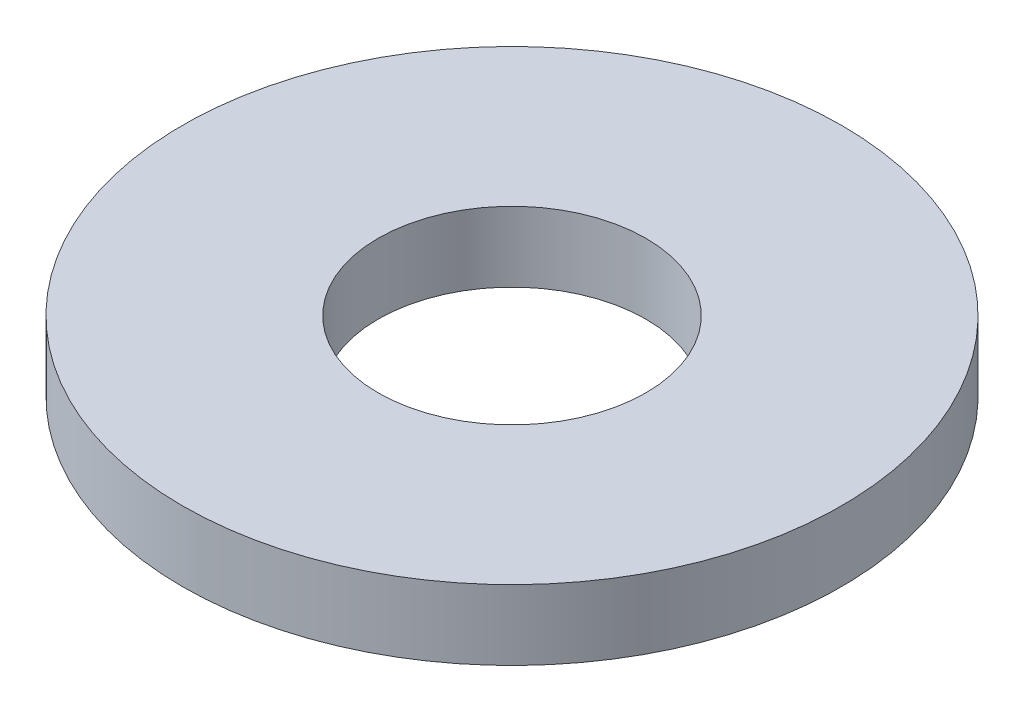
ISO-10303-21;
HEADER;
FILE_DESCRIPTION(('STEP AP214'),'2;1');
FILE_NAME('part.step','',(''),(''),'','','');
FILE_SCHEMA(('AUTOMOTIVE_DESIGN { 1 0 10303 214 1 1 1 1 }'));
ENDSEC;
DATA;
#1=APPLICATION_CONTEXT('core data for automotive mechanical design processes');
#2=APPLICATION_PROTOCOL_DEFINITION('international standard','automotive_design',2000,#1);
#3=PRODUCT_CONTEXT('',#1,'mechanical');
#4=PRODUCT('Part','Part','',(#3));
#5=PRODUCT_RELATED_PRODUCT_CATEGORY('part','',(#4));
#6=PRODUCT_DEFINITION_FORMATION('','',#4);
#7=PRODUCT_DEFINITION_CONTEXT('part definition',#1,'design');
#8=PRODUCT_DEFINITION('design','',#6,#7);
#9=PRODUCT_DEFINITION_SHAPE('','',#8);
#10=(LENGTH_UNIT() NAMED_UNIT(*) SI_UNIT(.MILLI.,.METRE.));
#11=(NAMED_UNIT(*) PLANE_ANGLE_UNIT() SI_UNIT($,.RADIAN.));
#12=(NAMED_UNIT(*) SI_UNIT($,.STERADIAN.) SOLID_ANGLE_UNIT());
#13=UNCERTAINTY_MEASURE_WITH_UNIT(LENGTH_MEASURE(1.E-05),#10,'distance_accuracy_value','');
#14=(GEOMETRIC_REPRESENTATION_CONTEXT(3) GLOBAL_UNCERTAINTY_ASSIGNED_CONTEXT((#13)) GLOBAL_UNIT_ASSIGNED_CONTEXT((#10,
#11,#12)) REPRESENTATION_CONTEXT('',''));
#15=CARTESIAN_POINT('',(0.,0.,0.));
#16=DIRECTION('',(0.,0.,1.));
#17=DIRECTION('',(1.,0.,0.));
#18=AXIS2_PLACEMENT_3D('',#15,#16,#17);
#19=CARTESIAN_POINT('',(0.,17.,0.));
#20=DIRECTION('',(0.,-1.,0.));
#21=DIRECTION('',(0.,0.,-1.));
#22=AXIS2_PLACEMENT_3D('',#19,#20,#21);
#23=CYLINDRICAL_SURFACE('',#22,80.);
#24=CARTESIAN_POINT('',(0.,17.,0.));
#25=DIRECTION('',(0.,1.,0.));
#26=DIRECTION('',(0.,0.,1.));
#27=AXIS2_PLACEMENT_3D('',#24,#25,#26);
#28=CIRCLE('',#27,80.);
#29=CARTESIAN_POINT('',(0.,17.,80.));
#30=VERTEX_POINT('',#29);
#31=EDGE_CURVE('E10',#30,#30,#28,.T.);
#32=ORIENTED_EDGE('',*,*,#31,.F.);
#33=EDGE_LOOP('',(#32));
#34=FACE_BOUND('',#33,.T.);
#35=CARTESIAN_POINT('',(0.,0.,0.));
#36=DIRECTION('',(0.,1.,0.));
#37=DIRECTION('',(0.,0.,1.));
#38=AXIS2_PLACEMENT_3D('',#35,#36,#37);
#39=CIRCLE('',#38,80.);
#40=CARTESIAN_POINT('',(0.,0.,80.));
#41=VERTEX_POINT('',#40);
#42=EDGE_CURVE('E37',#41,#41,#39,.T.);
#43=ORIENTED_EDGE('',*,*,#42,.T.);
#44=EDGE_LOOP('',(#43));
#45=FACE_BOUND('',#44,.T.);
#46=ADVANCED_FACE('F40',(#34,#45),#23,.T.);
#47=CARTESIAN_POINT('',(0.,17.,0.));
#48=DIRECTION('',(0.,1.,0.));
#49=DIRECTION('',(0.,0.,1.));
#50=AXIS2_PLACEMENT_3D('',#47,#48,#49);
#51=PLANE('',#50);
#52=CARTESIAN_POINT('',(0.,17.,0.));
#53=DIRECTION('',(0.,1.,0.));
#54=DIRECTION('',(0.,0.,1.));
#55=AXIS2_PLACEMENT_3D('',#52,#53,#54);
#56=CIRCLE('',#55,32.5);
#57=CARTESIAN_POINT('',(0.,17.,32.5));
#58=VERTEX_POINT('',#57);
#59=EDGE_CURVE('E50',#58,#58,#56,.T.);
#60=ORIENTED_EDGE('',*,*,#59,.F.);
#61=EDGE_LOOP('',(#60));
#62=FACE_BOUND('',#61,.T.);
#63=ORIENTED_EDGE('',*,*,#31,.T.);
#64=EDGE_LOOP('',(#63));
#65=FACE_BOUND('',#64,.T.);
#66=ADVANCED_FACE('F59',(#62,#65),#51,.T.);
#67=CARTESIAN_POINT('',(0.,0.,0.));
#68=DIRECTION('',(0.,1.,0.));
#69=DIRECTION('',(0.,0.,1.));
#70=AXIS2_PLACEMENT_3D('',#67,#68,#69);
#71=PLANE('',#70);
#72=CARTESIAN_POINT('',(0.,0.,0.));
#73=DIRECTION('',(0.,1.,0.));
#74=DIRECTION('',(0.,0.,1.));
#75=AXIS2_PLACEMENT_3D('',#72,#73,#74);
#76=CIRCLE('',#75,32.5);
#77=CARTESIAN_POINT('',(0.,0.,32.5));
#78=VERTEX_POINT('',#77);
#79=EDGE_CURVE('E47',#78,#78,#76,.T.);
#80=ORIENTED_EDGE('',*,*,#79,.T.);
#81=EDGE_LOOP('',(#80));
#82=FACE_BOUND('',#81,.T.);
#83=ORIENTED_EDGE('',*,*,#42,.F.);
#84=EDGE_LOOP('',(#83));
#85=FACE_BOUND('',#84,.T.);
#86=ADVANCED_FACE('F58',(#82,#85),#71,.F.);
#87=CARTESIAN_POINT('',(0.,17.,0.));
#88=DIRECTION('',(0.,-1.,0.));
#89=DIRECTION('',(0.,0.,-1.));
#90=AXIS2_PLACEMENT_3D('',#87,#88,#89);
#91=CYLINDRICAL_SURFACE('',#90,32.5);
#92=ORIENTED_EDGE('',*,*,#59,.T.);
#93=EDGE_LOOP('',(#92));
#94=FACE_BOUND('',#93,.T.);
#95=ORIENTED_EDGE('',*,*,#79,.F.);
#96=EDGE_LOOP('',(#95));
#97=FACE_BOUND('',#96,.T.);
#98=ADVANCED_FACE('F54',(#94,#97),#91,.F.);
#99=CLOSED_SHELL('',(#46,#66,#86,#98));
#100=MANIFOLD_SOLID_BREP('B2',#99);
#101=ADVANCED_BREP_SHAPE_REPRESENTATION('',(#18,#100),#14);
#102=SHAPE_DEFINITION_REPRESENTATION(#9,#101);
ENDSEC;
END-ISO-10303-21;
